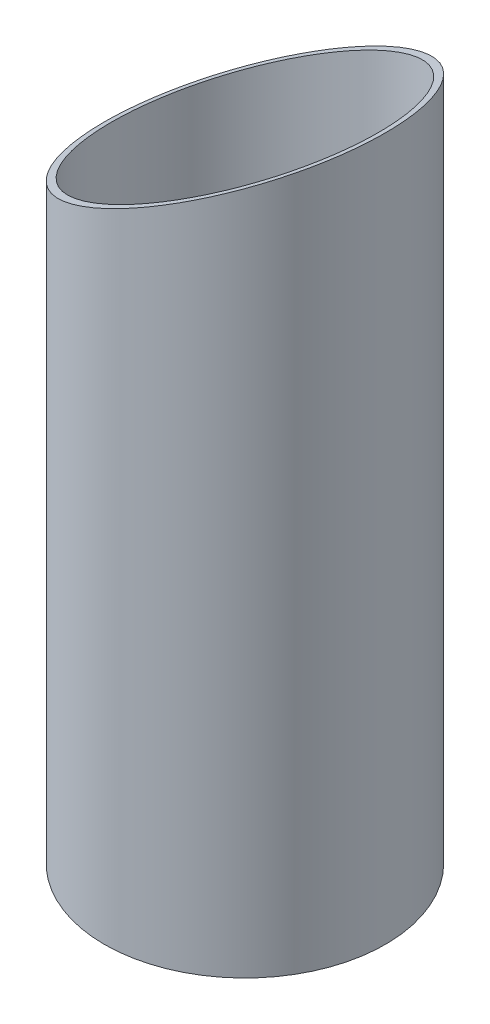
ISO-10303-21;
HEADER;
FILE_DESCRIPTION(('STEP AP214'),'2;1');
FILE_NAME('part.step','',(''),(''),'','','');
FILE_SCHEMA(('AUTOMOTIVE_DESIGN { 1 0 10303 214 1 1 1 1 }'));
ENDSEC;
DATA;
#1=APPLICATION_CONTEXT('core data for automotive mechanical design processes');
#2=APPLICATION_PROTOCOL_DEFINITION('international standard','automotive_design',2000,#1);
#3=PRODUCT_CONTEXT('',#1,'mechanical');
#4=PRODUCT('Part','Part','',(#3));
#5=PRODUCT_RELATED_PRODUCT_CATEGORY('part','',(#4));
#6=PRODUCT_DEFINITION_FORMATION('','',#4);
#7=PRODUCT_DEFINITION_CONTEXT('part definition',#1,'design');
#8=PRODUCT_DEFINITION('design','',#6,#7);
#9=PRODUCT_DEFINITION_SHAPE('','',#8);
#10=(LENGTH_UNIT() NAMED_UNIT(*) SI_UNIT(.MILLI.,.METRE.));
#11=(NAMED_UNIT(*) PLANE_ANGLE_UNIT() SI_UNIT($,.RADIAN.));
#12=(NAMED_UNIT(*) SI_UNIT($,.STERADIAN.) SOLID_ANGLE_UNIT());
#13=UNCERTAINTY_MEASURE_WITH_UNIT(LENGTH_MEASURE(1.E-05),#10,'distance_accuracy_value','');
#14=(GEOMETRIC_REPRESENTATION_CONTEXT(3) GLOBAL_UNCERTAINTY_ASSIGNED_CONTEXT((#13)) GLOBAL_UNIT_ASSIGNED_CONTEXT((#10,
#11,#12)) REPRESENTATION_CONTEXT('',''));
#15=CARTESIAN_POINT('',(0.,0.,0.));
#16=DIRECTION('',(0.,0.,1.));
#17=DIRECTION('',(1.,0.,0.));
#18=AXIS2_PLACEMENT_3D('',#15,#16,#17);
#19=CARTESIAN_POINT('',(0.,300.,0.));
#20=DIRECTION('',(0.,-1.,0.));
#21=DIRECTION('',(0.,0.,-1.));
#22=AXIS2_PLACEMENT_3D('',#19,#20,#21);
#23=CYLINDRICAL_SURFACE('',#22,40.);
#24=CARTESIAN_POINT('',(0.,0.,0.));
#25=DIRECTION('',(0.,1.,0.));
#26=DIRECTION('',(0.,0.,1.));
#27=AXIS2_PLACEMENT_3D('',#24,#25,#26);
#28=CIRCLE('',#27,40.);
#29=CARTESIAN_POINT('',(0.,0.,40.));
#30=VERTEX_POINT('',#29);
#31=EDGE_CURVE('E10',#30,#30,#28,.T.);
#32=ORIENTED_EDGE('',*,*,#31,.T.);
#33=EDGE_LOOP('',(#32));
#34=FACE_BOUND('',#33,.T.);
#35=CARTESIAN_POINT('',(0.,181.3476936738,0.));
#36=DIRECTION('',(-0.422618261740701,0.906307787036649,0.));
#37=DIRECTION('',(-0.906307787036649,-0.422618261740701,0.));
#38=AXIS2_PLACEMENT_3D('',#35,#36,#37);
#39=ELLIPSE('',#38,44.1351167584997,40.);
#40=CARTESIAN_POINT('',(-40.,162.6953873476,0.));
#41=VERTEX_POINT('',#40);
#42=EDGE_CURVE('E42',#41,#41,#39,.T.);
#43=ORIENTED_EDGE('',*,*,#42,.F.);
#44=EDGE_LOOP('',(#43));
#45=FACE_BOUND('',#44,.T.);
#46=ADVANCED_FACE('F31',(#34,#45),#23,.T.);
#47=CARTESIAN_POINT('',(0.,300.,0.));
#48=DIRECTION('',(0.,-1.,0.));
#49=DIRECTION('',(0.,0.,-1.));
#50=AXIS2_PLACEMENT_3D('',#47,#48,#49);
#51=CYLINDRICAL_SURFACE('',#50,38.);
#52=CARTESIAN_POINT('',(0.,0.,0.));
#53=DIRECTION('',(0.,1.,0.));
#54=DIRECTION('',(0.,0.,1.));
#55=AXIS2_PLACEMENT_3D('',#52,#53,#54);
#56=CIRCLE('',#55,38.);
#57=CARTESIAN_POINT('',(0.,0.,38.));
#58=VERTEX_POINT('',#57);
#59=EDGE_CURVE('E38',#58,#58,#56,.T.);
#60=ORIENTED_EDGE('',*,*,#59,.F.);
#61=EDGE_LOOP('',(#60));
#62=FACE_BOUND('',#61,.T.);
#63=CARTESIAN_POINT('',(0.,181.3476936738,0.));
#64=DIRECTION('',(-0.422618261740701,0.906307787036649,0.));
#65=DIRECTION('',(-0.906307787036649,-0.422618261740701,0.));
#66=AXIS2_PLACEMENT_3D('',#63,#64,#65);
#67=ELLIPSE('',#66,41.9283609205747,38.);
#68=CARTESIAN_POINT('',(-38.,163.62800266391,0.));
#69=VERTEX_POINT('',#68);
#70=EDGE_CURVE('E34',#69,#69,#67,.T.);
#71=ORIENTED_EDGE('',*,*,#70,.T.);
#72=EDGE_LOOP('',(#71));
#73=FACE_BOUND('',#72,.T.);
#74=ADVANCED_FACE('F51',(#62,#73),#51,.F.);
#75=CARTESIAN_POINT('',(0.,0.,0.));
#76=DIRECTION('',(0.,1.,0.));
#77=DIRECTION('',(0.,0.,1.));
#78=AXIS2_PLACEMENT_3D('',#75,#76,#77);
#79=PLANE('',#78);
#80=ORIENTED_EDGE('',*,*,#31,.F.);
#81=EDGE_LOOP('',(#80));
#82=FACE_BOUND('',#81,.T.);
#83=ORIENTED_EDGE('',*,*,#59,.T.);
#84=EDGE_LOOP('',(#83));
#85=FACE_BOUND('',#84,.T.);
#86=ADVANCED_FACE('F55',(#82,#85),#79,.F.);
#87=CARTESIAN_POINT('',(-71.3438436047622,148.079513038687,50.));
#88=DIRECTION('',(-0.422618261740701,0.906307787036649,0.));
#89=DIRECTION('',(-0.906307787036649,-0.422618261740701,0.));
#90=AXIS2_PLACEMENT_3D('',#87,#88,#89);
#91=PLANE('',#90);
#92=ORIENTED_EDGE('',*,*,#70,.F.);
#93=EDGE_LOOP('',(#92));
#94=FACE_BOUND('',#93,.T.);
#95=ORIENTED_EDGE('',*,*,#42,.T.);
#96=EDGE_LOOP('',(#95));
#97=FACE_BOUND('',#96,.T.);
#98=ADVANCED_FACE('F53',(#94,#97),#91,.T.);
#99=CLOSED_SHELL('',(#46,#74,#86,#98));
#100=MANIFOLD_SOLID_BREP('B2',#99);
#101=ADVANCED_BREP_SHAPE_REPRESENTATION('',(#18,#100),#14);
#102=SHAPE_DEFINITION_REPRESENTATION(#9,#101);
ENDSEC;
END-ISO-10303-21;
